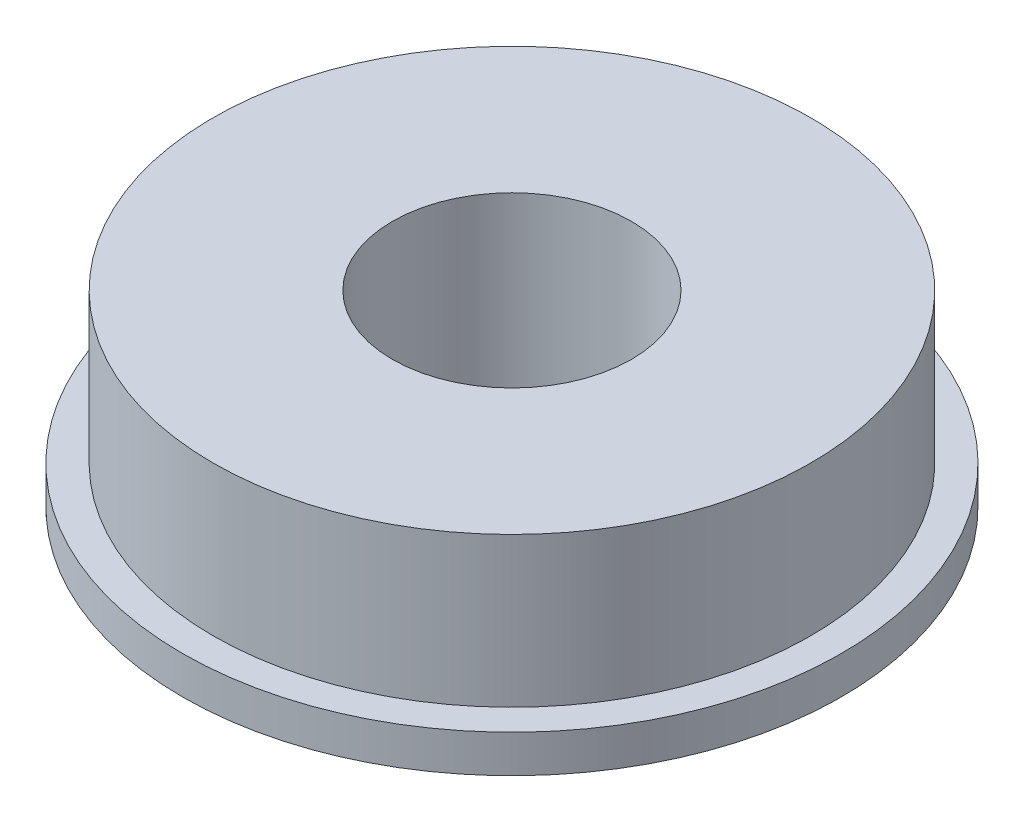
ISO-10303-21;
HEADER;
FILE_DESCRIPTION(('STEP AP214'),'2;1');
FILE_NAME('part.step','',(''),(''),'','','');
FILE_SCHEMA(('AUTOMOTIVE_DESIGN { 1 0 10303 214 1 1 1 1 }'));
ENDSEC;
DATA;
#1=APPLICATION_CONTEXT('core data for automotive mechanical design processes');
#2=APPLICATION_PROTOCOL_DEFINITION('international standard','automotive_design',2000,#1);
#3=PRODUCT_CONTEXT('',#1,'mechanical');
#4=PRODUCT('Part','Part','',(#3));
#5=PRODUCT_RELATED_PRODUCT_CATEGORY('part','',(#4));
#6=PRODUCT_DEFINITION_FORMATION('','',#4);
#7=PRODUCT_DEFINITION_CONTEXT('part definition',#1,'design');
#8=PRODUCT_DEFINITION('design','',#6,#7);
#9=PRODUCT_DEFINITION_SHAPE('','',#8);
#10=(LENGTH_UNIT() NAMED_UNIT(*) SI_UNIT(.MILLI.,.METRE.));
#11=(NAMED_UNIT(*) PLANE_ANGLE_UNIT() SI_UNIT($,.RADIAN.));
#12=(NAMED_UNIT(*) SI_UNIT($,.STERADIAN.) SOLID_ANGLE_UNIT());
#13=UNCERTAINTY_MEASURE_WITH_UNIT(LENGTH_MEASURE(1.E-05),#10,'distance_accuracy_value','');
#14=(GEOMETRIC_REPRESENTATION_CONTEXT(3) GLOBAL_UNCERTAINTY_ASSIGNED_CONTEXT((#13)) GLOBAL_UNIT_ASSIGNED_CONTEXT((#10,
#11,#12)) REPRESENTATION_CONTEXT('',''));
#15=CARTESIAN_POINT('',(0.,0.,0.));
#16=DIRECTION('',(0.,0.,1.));
#17=DIRECTION('',(1.,0.,0.));
#18=AXIS2_PLACEMENT_3D('',#15,#16,#17);
#19=CARTESIAN_POINT('',(0.,1.,0.));
#20=DIRECTION('',(0.,-1.,0.));
#21=DIRECTION('',(0.,0.,-1.));
#22=AXIS2_PLACEMENT_3D('',#19,#20,#21);
#23=CYLINDRICAL_SURFACE('',#22,8.75);
#24=CARTESIAN_POINT('',(0.,1.,0.));
#25=DIRECTION('',(0.,1.,0.));
#26=DIRECTION('',(0.,0.,1.));
#27=AXIS2_PLACEMENT_3D('',#24,#25,#26);
#28=CIRCLE('',#27,8.75);
#29=CARTESIAN_POINT('',(0.,1.,8.75));
#30=VERTEX_POINT('',#29);
#31=EDGE_CURVE('E45',#30,#30,#28,.T.);
#32=ORIENTED_EDGE('',*,*,#31,.F.);
#33=EDGE_LOOP('',(#32));
#34=FACE_BOUND('',#33,.T.);
#35=CARTESIAN_POINT('',(0.,0.,0.));
#36=DIRECTION('',(0.,1.,0.));
#37=DIRECTION('',(0.,0.,1.));
#38=AXIS2_PLACEMENT_3D('',#35,#36,#37);
#39=CIRCLE('',#38,8.75);
#40=CARTESIAN_POINT('',(0.,0.,8.75));
#41=VERTEX_POINT('',#40);
#42=EDGE_CURVE('E40',#41,#41,#39,.T.);
#43=ORIENTED_EDGE('',*,*,#42,.T.);
#44=EDGE_LOOP('',(#43));
#45=FACE_BOUND('',#44,.T.);
#46=ADVANCED_FACE('F37',(#34,#45),#23,.T.);
#47=CARTESIAN_POINT('',(0.,1.,0.));
#48=DIRECTION('',(0.,1.,0.));
#49=DIRECTION('',(0.,0.,1.));
#50=AXIS2_PLACEMENT_3D('',#47,#48,#49);
#51=PLANE('',#50);
#52=CARTESIAN_POINT('',(0.,1.,0.));
#53=DIRECTION('',(0.,1.,0.));
#54=DIRECTION('',(0.,0.,1.));
#55=AXIS2_PLACEMENT_3D('',#52,#53,#54);
#56=CIRCLE('',#55,7.9375);
#57=CARTESIAN_POINT('',(0.,1.,7.9375));
#58=VERTEX_POINT('',#57);
#59=EDGE_CURVE('E10',#58,#58,#56,.T.);
#60=ORIENTED_EDGE('',*,*,#59,.F.);
#61=EDGE_LOOP('',(#60));
#62=FACE_BOUND('',#61,.T.);
#63=ORIENTED_EDGE('',*,*,#31,.T.);
#64=EDGE_LOOP('',(#63));
#65=FACE_BOUND('',#64,.T.);
#66=ADVANCED_FACE('F86',(#62,#65),#51,.T.);
#67=CARTESIAN_POINT('',(0.,0.,0.));
#68=DIRECTION('',(0.,1.,0.));
#69=DIRECTION('',(0.,0.,1.));
#70=AXIS2_PLACEMENT_3D('',#67,#68,#69);
#71=PLANE('',#70);
#72=CARTESIAN_POINT('',(0.,0.,0.));
#73=DIRECTION('',(0.,1.,0.));
#74=DIRECTION('',(0.,0.,1.));
#75=AXIS2_PLACEMENT_3D('',#72,#73,#74);
#76=CIRCLE('',#75,3.175);
#77=CARTESIAN_POINT('',(0.,0.,3.175));
#78=VERTEX_POINT('',#77);
#79=EDGE_CURVE('E56',#78,#78,#76,.T.);
#80=ORIENTED_EDGE('',*,*,#79,.T.);
#81=EDGE_LOOP('',(#80));
#82=FACE_BOUND('',#81,.T.);
#83=ORIENTED_EDGE('',*,*,#42,.F.);
#84=EDGE_LOOP('',(#83));
#85=FACE_BOUND('',#84,.T.);
#86=ADVANCED_FACE('F65',(#82,#85),#71,.F.);
#87=CARTESIAN_POINT('',(0.,4.973,0.));
#88=DIRECTION('',(0.,-1.,0.));
#89=DIRECTION('',(0.,0.,-1.));
#90=AXIS2_PLACEMENT_3D('',#87,#88,#89);
#91=CYLINDRICAL_SURFACE('',#90,7.9375);
#92=CARTESIAN_POINT('',(0.,4.973,0.));
#93=DIRECTION('',(0.,1.,0.));
#94=DIRECTION('',(0.,0.,1.));
#95=AXIS2_PLACEMENT_3D('',#92,#93,#94);
#96=CIRCLE('',#95,7.9375);
#97=CARTESIAN_POINT('',(0.,4.973,7.9375));
#98=VERTEX_POINT('',#97);
#99=EDGE_CURVE('E52',#98,#98,#96,.T.);
#100=ORIENTED_EDGE('',*,*,#99,.F.);
#101=EDGE_LOOP('',(#100));
#102=FACE_BOUND('',#101,.T.);
#103=ORIENTED_EDGE('',*,*,#59,.T.);
#104=EDGE_LOOP('',(#103));
#105=FACE_BOUND('',#104,.T.);
#106=ADVANCED_FACE('F77',(#102,#105),#91,.T.);
#107=CARTESIAN_POINT('',(0.,4.973,0.));
#108=DIRECTION('',(0.,1.,0.));
#109=DIRECTION('',(0.,0.,1.));
#110=AXIS2_PLACEMENT_3D('',#107,#108,#109);
#111=PLANE('',#110);
#112=CARTESIAN_POINT('',(0.,4.973,0.));
#113=DIRECTION('',(0.,1.,0.));
#114=DIRECTION('',(0.,0.,1.));
#115=AXIS2_PLACEMENT_3D('',#112,#113,#114);
#116=CIRCLE('',#115,3.175);
#117=CARTESIAN_POINT('',(0.,4.973,3.175));
#118=VERTEX_POINT('',#117);
#119=EDGE_CURVE('E57',#118,#118,#116,.T.);
#120=ORIENTED_EDGE('',*,*,#119,.F.);
#121=EDGE_LOOP('',(#120));
#122=FACE_BOUND('',#121,.T.);
#123=ORIENTED_EDGE('',*,*,#99,.T.);
#124=EDGE_LOOP('',(#123));
#125=FACE_BOUND('',#124,.T.);
#126=ADVANCED_FACE('F71',(#122,#125),#111,.T.);
#127=CARTESIAN_POINT('',(0.,0.,0.));
#128=DIRECTION('',(0.,1.,0.));
#129=DIRECTION('',(0.,0.,1.));
#130=AXIS2_PLACEMENT_3D('',#127,#128,#129);
#131=CYLINDRICAL_SURFACE('',#130,3.175);
#132=ORIENTED_EDGE('',*,*,#79,.F.);
#133=EDGE_LOOP('',(#132));
#134=FACE_BOUND('',#133,.T.);
#135=ORIENTED_EDGE('',*,*,#119,.T.);
#136=EDGE_LOOP('',(#135));
#137=FACE_BOUND('',#136,.T.);
#138=ADVANCED_FACE('F68',(#134,#137),#131,.F.);
#139=CLOSED_SHELL('',(#46,#66,#86,#106,#126,#138));
#140=MANIFOLD_SOLID_BREP('B2',#139);
#141=ADVANCED_BREP_SHAPE_REPRESENTATION('',(#18,#140),#14);
#142=SHAPE_DEFINITION_REPRESENTATION(#9,#141);
ENDSEC;
END-ISO-10303-21;
